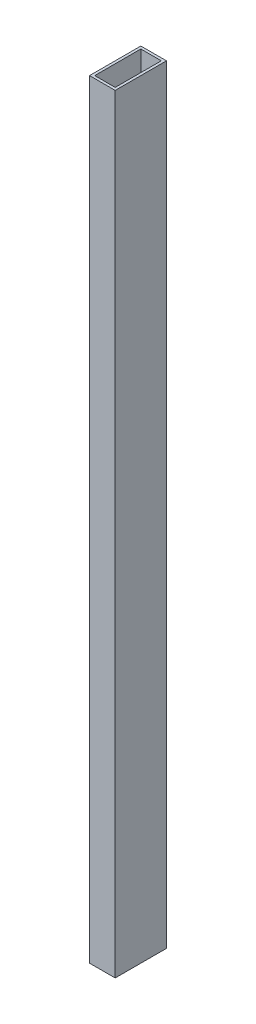
ISO-10303-21;
HEADER;
FILE_DESCRIPTION(('STEP AP214'),'2;1');
FILE_NAME('part.step','',(''),(''),'','','');
FILE_SCHEMA(('AUTOMOTIVE_DESIGN { 1 0 10303 214 1 1 1 1 }'));
ENDSEC;
DATA;
#1=APPLICATION_CONTEXT('core data for automotive mechanical design processes');
#2=APPLICATION_PROTOCOL_DEFINITION('international standard','automotive_design',2000,#1);
#3=PRODUCT_CONTEXT('',#1,'mechanical');
#4=PRODUCT('Part','Part','',(#3));
#5=PRODUCT_RELATED_PRODUCT_CATEGORY('part','',(#4));
#6=PRODUCT_DEFINITION_FORMATION('','',#4);
#7=PRODUCT_DEFINITION_CONTEXT('part definition',#1,'design');
#8=PRODUCT_DEFINITION('design','',#6,#7);
#9=PRODUCT_DEFINITION_SHAPE('','',#8);
#10=(LENGTH_UNIT() NAMED_UNIT(*) SI_UNIT(.MILLI.,.METRE.));
#11=(NAMED_UNIT(*) PLANE_ANGLE_UNIT() SI_UNIT($,.RADIAN.));
#12=(NAMED_UNIT(*) SI_UNIT($,.STERADIAN.) SOLID_ANGLE_UNIT());
#13=UNCERTAINTY_MEASURE_WITH_UNIT(LENGTH_MEASURE(1.E-05),#10,'distance_accuracy_value','');
#14=(GEOMETRIC_REPRESENTATION_CONTEXT(3) GLOBAL_UNCERTAINTY_ASSIGNED_CONTEXT((#13)) GLOBAL_UNIT_ASSIGNED_CONTEXT((#10,
#11,#12)) REPRESENTATION_CONTEXT('',''));
#15=CARTESIAN_POINT('',(0.,0.,0.));
#16=DIRECTION('',(0.,0.,1.));
#17=DIRECTION('',(1.,0.,0.));
#18=AXIS2_PLACEMENT_3D('',#15,#16,#17);
#19=CARTESIAN_POINT('',(0.,300.,0.));
#20=DIRECTION('',(0.,1.,0.));
#21=DIRECTION('',(0.,0.,1.));
#22=AXIS2_PLACEMENT_3D('',#19,#20,#21);
#23=PLANE('',#22);
#24=DIRECTION('',(0.,0.,1.));
#25=VECTOR('',#24,1.);
#26=CARTESIAN_POINT('',(-5.,300.,10.));
#27=LINE('',#26,#25);
#28=CARTESIAN_POINT('',(-5.,300.,-9.99999999999999));
#29=VERTEX_POINT('',#28);
#30=CARTESIAN_POINT('',(-5.,300.,10.));
#31=VERTEX_POINT('',#30);
#32=EDGE_CURVE('E135',#29,#31,#27,.T.);
#33=ORIENTED_EDGE('',*,*,#32,.T.);
#34=DIRECTION('',(1.,0.,0.));
#35=VECTOR('',#34,1.);
#36=CARTESIAN_POINT('',(5.,300.,10.));
#37=LINE('',#36,#35);
#38=CARTESIAN_POINT('',(5.,300.,10.));
#39=VERTEX_POINT('',#38);
#40=EDGE_CURVE('E138',#31,#39,#37,.T.);
#41=ORIENTED_EDGE('',*,*,#40,.T.);
#42=DIRECTION('',(0.,0.,-1.));
#43=VECTOR('',#42,1.);
#44=CARTESIAN_POINT('',(5.,300.,10.));
#45=LINE('',#44,#43);
#46=CARTESIAN_POINT('',(5.,300.,-10.));
#47=VERTEX_POINT('',#46);
#48=EDGE_CURVE('E141',#39,#47,#45,.T.);
#49=ORIENTED_EDGE('',*,*,#48,.T.);
#50=DIRECTION('',(-1.,0.,0.));
#51=VECTOR('',#50,1.);
#52=CARTESIAN_POINT('',(5.,300.,-10.));
#53=LINE('',#52,#51);
#54=EDGE_CURVE('E143',#47,#29,#53,.T.);
#55=ORIENTED_EDGE('',*,*,#54,.T.);
#56=EDGE_LOOP('',(#33,#41,#49,#55));
#57=FACE_BOUND('',#56,.T.);
#58=DIRECTION('',(1.,0.,0.));
#59=VECTOR('',#58,1.);
#60=CARTESIAN_POINT('',(4.,300.,9.));
#61=LINE('',#60,#59);
#62=CARTESIAN_POINT('',(-4.,300.,9.));
#63=VERTEX_POINT('',#62);
#64=CARTESIAN_POINT('',(4.,300.,9.));
#65=VERTEX_POINT('',#64);
#66=EDGE_CURVE('E107',#63,#65,#61,.T.);
#67=ORIENTED_EDGE('',*,*,#66,.F.);
#68=DIRECTION('',(0.,0.,1.));
#69=VECTOR('',#68,1.);
#70=CARTESIAN_POINT('',(-4.,300.,9.));
#71=LINE('',#70,#69);
#72=CARTESIAN_POINT('',(-4.,300.,-9.));
#73=VERTEX_POINT('',#72);
#74=EDGE_CURVE('E99',#73,#63,#71,.T.);
#75=ORIENTED_EDGE('',*,*,#74,.F.);
#76=DIRECTION('',(-1.,0.,0.));
#77=VECTOR('',#76,1.);
#78=CARTESIAN_POINT('',(4.,300.,-9.));
#79=LINE('',#78,#77);
#80=CARTESIAN_POINT('',(4.,300.,-9.));
#81=VERTEX_POINT('',#80);
#82=EDGE_CURVE('E121',#81,#73,#79,.T.);
#83=ORIENTED_EDGE('',*,*,#82,.F.);
#84=DIRECTION('',(0.,0.,-1.));
#85=VECTOR('',#84,1.);
#86=CARTESIAN_POINT('',(4.,300.,9.));
#87=LINE('',#86,#85);
#88=EDGE_CURVE('E119',#65,#81,#87,.T.);
#89=ORIENTED_EDGE('',*,*,#88,.F.);
#90=EDGE_LOOP('',(#67,#75,#83,#89));
#91=FACE_BOUND('',#90,.T.);
#92=ADVANCED_FACE('F34',(#57,#91),#23,.T.);
#93=CARTESIAN_POINT('',(0.,0.,0.));
#94=DIRECTION('',(0.,1.,0.));
#95=DIRECTION('',(0.,0.,1.));
#96=AXIS2_PLACEMENT_3D('',#93,#94,#95);
#97=PLANE('',#96);
#98=DIRECTION('',(0.,0.,1.));
#99=VECTOR('',#98,1.);
#100=CARTESIAN_POINT('',(-5.,0.,10.));
#101=LINE('',#100,#99);
#102=CARTESIAN_POINT('',(-5.,0.,-9.99999999999999));
#103=VERTEX_POINT('',#102);
#104=CARTESIAN_POINT('',(-5.,0.,10.));
#105=VERTEX_POINT('',#104);
#106=EDGE_CURVE('E115',#103,#105,#101,.T.);
#107=ORIENTED_EDGE('',*,*,#106,.F.);
#108=DIRECTION('',(-1.,0.,0.));
#109=VECTOR('',#108,1.);
#110=CARTESIAN_POINT('',(5.,0.,-10.));
#111=LINE('',#110,#109);
#112=CARTESIAN_POINT('',(5.,0.,-10.));
#113=VERTEX_POINT('',#112);
#114=EDGE_CURVE('E139',#113,#103,#111,.T.);
#115=ORIENTED_EDGE('',*,*,#114,.F.);
#116=DIRECTION('',(0.,0.,-1.));
#117=VECTOR('',#116,1.);
#118=CARTESIAN_POINT('',(5.,0.,10.));
#119=LINE('',#118,#117);
#120=CARTESIAN_POINT('',(5.,0.,10.));
#121=VERTEX_POINT('',#120);
#122=EDGE_CURVE('E150',#121,#113,#119,.T.);
#123=ORIENTED_EDGE('',*,*,#122,.F.);
#124=DIRECTION('',(1.,0.,0.));
#125=VECTOR('',#124,1.);
#126=CARTESIAN_POINT('',(5.,0.,10.));
#127=LINE('',#126,#125);
#128=EDGE_CURVE('E148',#105,#121,#127,.T.);
#129=ORIENTED_EDGE('',*,*,#128,.F.);
#130=EDGE_LOOP('',(#107,#115,#123,#129));
#131=FACE_BOUND('',#130,.T.);
#132=DIRECTION('',(0.,0.,1.));
#133=VECTOR('',#132,1.);
#134=CARTESIAN_POINT('',(-4.,0.,9.));
#135=LINE('',#134,#133);
#136=CARTESIAN_POINT('',(-4.,0.,-9.));
#137=VERTEX_POINT('',#136);
#138=CARTESIAN_POINT('',(-4.,0.,9.));
#139=VERTEX_POINT('',#138);
#140=EDGE_CURVE('E57',#137,#139,#135,.T.);
#141=ORIENTED_EDGE('',*,*,#140,.T.);
#142=DIRECTION('',(1.,0.,0.));
#143=VECTOR('',#142,1.);
#144=CARTESIAN_POINT('',(4.,0.,9.));
#145=LINE('',#144,#143);
#146=CARTESIAN_POINT('',(4.,0.,9.));
#147=VERTEX_POINT('',#146);
#148=EDGE_CURVE('E114',#139,#147,#145,.T.);
#149=ORIENTED_EDGE('',*,*,#148,.T.);
#150=DIRECTION('',(0.,0.,-1.));
#151=VECTOR('',#150,1.);
#152=CARTESIAN_POINT('',(4.,0.,9.));
#153=LINE('',#152,#151);
#154=CARTESIAN_POINT('',(4.,0.,-9.));
#155=VERTEX_POINT('',#154);
#156=EDGE_CURVE('E127',#147,#155,#153,.T.);
#157=ORIENTED_EDGE('',*,*,#156,.T.);
#158=DIRECTION('',(-1.,0.,0.));
#159=VECTOR('',#158,1.);
#160=CARTESIAN_POINT('',(4.,0.,-9.));
#161=LINE('',#160,#159);
#162=EDGE_CURVE('E108',#155,#137,#161,.T.);
#163=ORIENTED_EDGE('',*,*,#162,.T.);
#164=EDGE_LOOP('',(#141,#149,#157,#163));
#165=FACE_BOUND('',#164,.T.);
#166=ADVANCED_FACE('F168',(#131,#165),#97,.F.);
#167=CARTESIAN_POINT('',(-5.,300.,10.));
#168=DIRECTION('',(1.,0.,0.));
#169=DIRECTION('',(0.,0.,-1.));
#170=AXIS2_PLACEMENT_3D('',#167,#168,#169);
#171=PLANE('',#170);
#172=ORIENTED_EDGE('',*,*,#106,.T.);
#173=DIRECTION('',(0.,-1.,0.));
#174=VECTOR('',#173,1.);
#175=CARTESIAN_POINT('',(-5.,300.,10.));
#176=LINE('',#175,#174);
#177=EDGE_CURVE('E11',#31,#105,#176,.T.);
#178=ORIENTED_EDGE('',*,*,#177,.F.);
#179=ORIENTED_EDGE('',*,*,#32,.F.);
#180=DIRECTION('',(0.,-1.,0.));
#181=VECTOR('',#180,1.);
#182=CARTESIAN_POINT('',(-5.,300.,-9.99999999999999));
#183=LINE('',#182,#181);
#184=EDGE_CURVE('E145',#29,#103,#183,.T.);
#185=ORIENTED_EDGE('',*,*,#184,.T.);
#186=EDGE_LOOP('',(#172,#178,#179,#185));
#187=FACE_BOUND('',#186,.T.);
#188=ADVANCED_FACE('F36',(#187),#171,.F.);
#189=CARTESIAN_POINT('',(5.,300.,10.));
#190=DIRECTION('',(0.,0.,-1.));
#191=DIRECTION('',(-1.,0.,0.));
#192=AXIS2_PLACEMENT_3D('',#189,#190,#191);
#193=PLANE('',#192);
#194=ORIENTED_EDGE('',*,*,#128,.T.);
#195=DIRECTION('',(0.,-1.,0.));
#196=VECTOR('',#195,1.);
#197=CARTESIAN_POINT('',(5.,300.,10.));
#198=LINE('',#197,#196);
#199=EDGE_CURVE('E42',#39,#121,#198,.T.);
#200=ORIENTED_EDGE('',*,*,#199,.F.);
#201=ORIENTED_EDGE('',*,*,#40,.F.);
#202=ORIENTED_EDGE('',*,*,#177,.T.);
#203=EDGE_LOOP('',(#194,#200,#201,#202));
#204=FACE_BOUND('',#203,.T.);
#205=ADVANCED_FACE('F178',(#204),#193,.F.);
#206=CARTESIAN_POINT('',(5.,300.,10.));
#207=DIRECTION('',(-1.,0.,0.));
#208=DIRECTION('',(0.,0.,1.));
#209=AXIS2_PLACEMENT_3D('',#206,#207,#208);
#210=PLANE('',#209);
#211=ORIENTED_EDGE('',*,*,#122,.T.);
#212=DIRECTION('',(0.,-1.,0.));
#213=VECTOR('',#212,1.);
#214=CARTESIAN_POINT('',(5.,300.,-10.));
#215=LINE('',#214,#213);
#216=EDGE_CURVE('E155',#47,#113,#215,.T.);
#217=ORIENTED_EDGE('',*,*,#216,.F.);
#218=ORIENTED_EDGE('',*,*,#48,.F.);
#219=ORIENTED_EDGE('',*,*,#199,.T.);
#220=EDGE_LOOP('',(#211,#217,#218,#219));
#221=FACE_BOUND('',#220,.T.);
#222=ADVANCED_FACE('F162',(#221),#210,.F.);
#223=CARTESIAN_POINT('',(5.,300.,-10.));
#224=DIRECTION('',(0.,0.,1.));
#225=DIRECTION('',(1.,0.,0.));
#226=AXIS2_PLACEMENT_3D('',#223,#224,#225);
#227=PLANE('',#226);
#228=ORIENTED_EDGE('',*,*,#114,.T.);
#229=ORIENTED_EDGE('',*,*,#184,.F.);
#230=ORIENTED_EDGE('',*,*,#54,.F.);
#231=ORIENTED_EDGE('',*,*,#216,.T.);
#232=EDGE_LOOP('',(#228,#229,#230,#231));
#233=FACE_BOUND('',#232,.T.);
#234=ADVANCED_FACE('F172',(#233),#227,.F.);
#235=CARTESIAN_POINT('',(-4.,300.,9.));
#236=DIRECTION('',(1.,0.,0.));
#237=DIRECTION('',(0.,0.,-1.));
#238=AXIS2_PLACEMENT_3D('',#235,#236,#237);
#239=PLANE('',#238);
#240=ORIENTED_EDGE('',*,*,#140,.F.);
#241=DIRECTION('',(0.,-1.,0.));
#242=VECTOR('',#241,1.);
#243=CARTESIAN_POINT('',(-4.,300.,-9.));
#244=LINE('',#243,#242);
#245=EDGE_CURVE('E103',#73,#137,#244,.T.);
#246=ORIENTED_EDGE('',*,*,#245,.F.);
#247=ORIENTED_EDGE('',*,*,#74,.T.);
#248=DIRECTION('',(0.,-1.,0.));
#249=VECTOR('',#248,1.);
#250=CARTESIAN_POINT('',(-4.,300.,9.));
#251=LINE('',#250,#249);
#252=EDGE_CURVE('E102',#63,#139,#251,.T.);
#253=ORIENTED_EDGE('',*,*,#252,.T.);
#254=EDGE_LOOP('',(#240,#246,#247,#253));
#255=FACE_BOUND('',#254,.T.);
#256=ADVANCED_FACE('F101',(#255),#239,.T.);
#257=CARTESIAN_POINT('',(4.,300.,9.));
#258=DIRECTION('',(0.,0.,-1.));
#259=DIRECTION('',(-1.,0.,0.));
#260=AXIS2_PLACEMENT_3D('',#257,#258,#259);
#261=PLANE('',#260);
#262=ORIENTED_EDGE('',*,*,#148,.F.);
#263=ORIENTED_EDGE('',*,*,#252,.F.);
#264=ORIENTED_EDGE('',*,*,#66,.T.);
#265=DIRECTION('',(0.,-1.,0.));
#266=VECTOR('',#265,1.);
#267=CARTESIAN_POINT('',(4.,300.,9.));
#268=LINE('',#267,#266);
#269=EDGE_CURVE('E116',#65,#147,#268,.T.);
#270=ORIENTED_EDGE('',*,*,#269,.T.);
#271=EDGE_LOOP('',(#262,#263,#264,#270));
#272=FACE_BOUND('',#271,.T.);
#273=ADVANCED_FACE('F111',(#272),#261,.T.);
#274=CARTESIAN_POINT('',(4.,300.,9.));
#275=DIRECTION('',(-1.,0.,0.));
#276=DIRECTION('',(0.,0.,1.));
#277=AXIS2_PLACEMENT_3D('',#274,#275,#276);
#278=PLANE('',#277);
#279=ORIENTED_EDGE('',*,*,#156,.F.);
#280=ORIENTED_EDGE('',*,*,#269,.F.);
#281=ORIENTED_EDGE('',*,*,#88,.T.);
#282=DIRECTION('',(0.,-1.,0.));
#283=VECTOR('',#282,1.);
#284=CARTESIAN_POINT('',(4.,300.,-9.));
#285=LINE('',#284,#283);
#286=EDGE_CURVE('E49',#81,#155,#285,.T.);
#287=ORIENTED_EDGE('',*,*,#286,.T.);
#288=EDGE_LOOP('',(#279,#280,#281,#287));
#289=FACE_BOUND('',#288,.T.);
#290=ADVANCED_FACE('F201',(#289),#278,.T.);
#291=CARTESIAN_POINT('',(4.,300.,-9.));
#292=DIRECTION('',(0.,0.,1.));
#293=DIRECTION('',(1.,0.,0.));
#294=AXIS2_PLACEMENT_3D('',#291,#292,#293);
#295=PLANE('',#294);
#296=ORIENTED_EDGE('',*,*,#162,.F.);
#297=ORIENTED_EDGE('',*,*,#286,.F.);
#298=ORIENTED_EDGE('',*,*,#82,.T.);
#299=ORIENTED_EDGE('',*,*,#245,.T.);
#300=EDGE_LOOP('',(#296,#297,#298,#299));
#301=FACE_BOUND('',#300,.T.);
#302=ADVANCED_FACE('F205',(#301),#295,.T.);
#303=CLOSED_SHELL('',(#92,#166,#188,#205,#222,#234,#256,#273,#290,#302));
#304=MANIFOLD_SOLID_BREP('B2',#303);
#305=ADVANCED_BREP_SHAPE_REPRESENTATION('',(#18,#304),#14);
#306=SHAPE_DEFINITION_REPRESENTATION(#9,#305);
ENDSEC;
END-ISO-10303-21;
